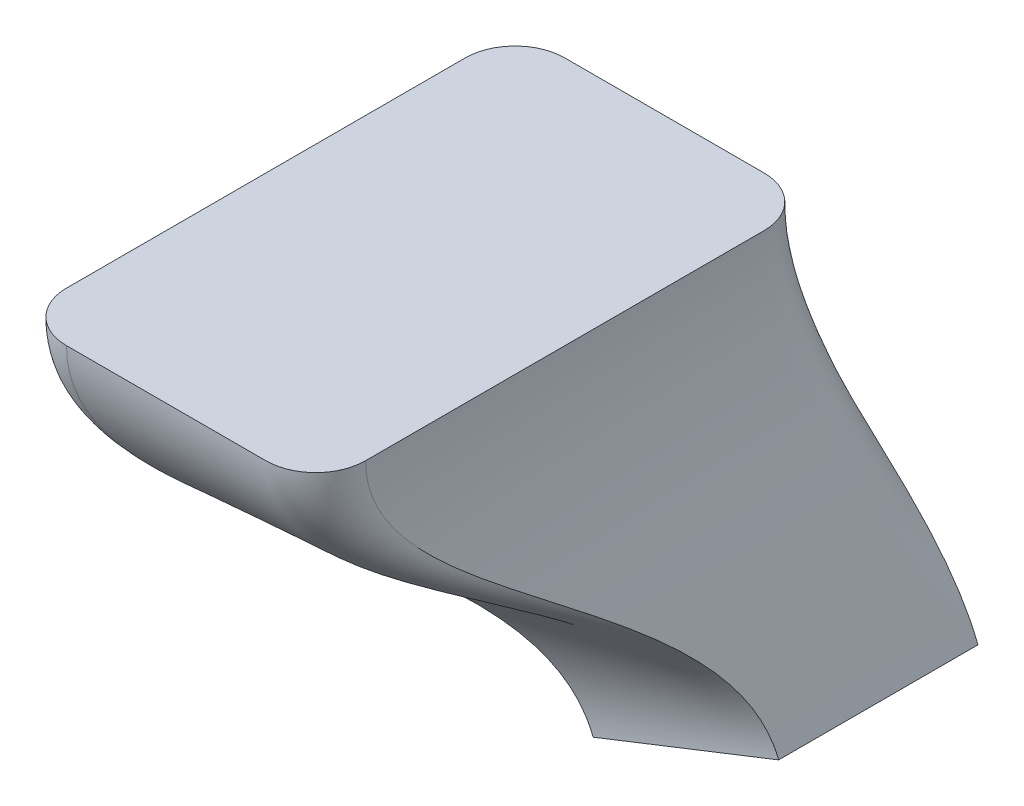
ISO-10303-21;
HEADER;
FILE_DESCRIPTION(('STEP AP214'),'2;1');
FILE_NAME('part.step','',(''),(''),'','','');
FILE_SCHEMA(('AUTOMOTIVE_DESIGN { 1 0 10303 214 1 1 1 1 }'));
ENDSEC;
DATA;
#1=APPLICATION_CONTEXT('core data for automotive mechanical design processes');
#2=APPLICATION_PROTOCOL_DEFINITION('international standard','automotive_design',2000,#1);
#3=PRODUCT_CONTEXT('',#1,'mechanical');
#4=PRODUCT('Part','Part','',(#3));
#5=PRODUCT_RELATED_PRODUCT_CATEGORY('part','',(#4));
#6=PRODUCT_DEFINITION_FORMATION('','',#4);
#7=PRODUCT_DEFINITION_CONTEXT('part definition',#1,'design');
#8=PRODUCT_DEFINITION('design','',#6,#7);
#9=PRODUCT_DEFINITION_SHAPE('','',#8);
#10=(LENGTH_UNIT() NAMED_UNIT(*) SI_UNIT(.MILLI.,.METRE.));
#11=(NAMED_UNIT(*) PLANE_ANGLE_UNIT() SI_UNIT($,.RADIAN.));
#12=(NAMED_UNIT(*) SI_UNIT($,.STERADIAN.) SOLID_ANGLE_UNIT());
#13=UNCERTAINTY_MEASURE_WITH_UNIT(LENGTH_MEASURE(1.E-05),#10,'distance_accuracy_value','');
#14=(GEOMETRIC_REPRESENTATION_CONTEXT(3) GLOBAL_UNCERTAINTY_ASSIGNED_CONTEXT((#13)) GLOBAL_UNIT_ASSIGNED_CONTEXT((#10,
#11,#12)) REPRESENTATION_CONTEXT('',''));
#15=CARTESIAN_POINT('',(0.,0.,0.));
#16=DIRECTION('',(0.,0.,1.));
#17=DIRECTION('',(1.,0.,0.));
#18=AXIS2_PLACEMENT_3D('',#15,#16,#17);
#19=CARTESIAN_POINT('',(91.5886055755659,0.,0.));
#20=CARTESIAN_POINT('',(91.5886055755659,-127.568491475437,0.));
#21=CARTESIAN_POINT('',(195.455030253132,-239.767306015432,-52.2088786404502));
#22=CARTESIAN_POINT('',(243.699720401359,-362.248980616551,-52.2088786404502));
#23=CARTESIAN_POINT('',(92.2895551109354,0.,0.));
#24=CARTESIAN_POINT('',(92.2895551109354,-127.441071303254,0.));
#25=CARTESIAN_POINT('',(197.035138804204,-239.231142171561,-52.2088786404502));
#26=CARTESIAN_POINT('',(245.250425520115,-361.638168523973,-52.2088786404502));
#27=CARTESIAN_POINT('',(93.6914541816744,0.,0.));
#28=CARTESIAN_POINT('',(93.6914541816744,-127.186230958887,0.));
#29=CARTESIAN_POINT('',(200.195355906347,-238.158814483818,-52.2088786404503));
#30=CARTESIAN_POINT('',(248.351835757628,-360.416544338816,-52.2088786404503));
#31=CARTESIAN_POINT('',(95.7943027877829,0.,0.));
#32=CARTESIAN_POINT('',(95.7943027877829,-126.810076949941,0.));
#33=CARTESIAN_POINT('',(204.933443602349,-236.544641316642,-52.2088786404501));
#34=CARTESIAN_POINT('',(253.003951113897,-358.584108061077,-52.2088786404501));
#35=CARTESIAN_POINT('',(97.8971513938914,0.,0.));
#36=CARTESIAN_POINT('',(97.8971513938914,-126.438018198312,0.));
#37=CARTESIAN_POINT('',(209.670030438736,-234.926657827579,-52.2088786404503));
#38=CARTESIAN_POINT('',(257.656066470167,-356.751671783342,-52.2088786404503));
#39=CARTESIAN_POINT('',(99.2990504646304,0.,0.));
#40=CARTESIAN_POINT('',(99.2990504646304,-126.194097116168,0.));
#41=CARTESIAN_POINT('',(212.826245770435,-233.844170606342,-52.2088786404502));
#42=CARTESIAN_POINT('',(260.757476707679,-355.530047598184,-52.2088786404502));
#43=CARTESIAN_POINT('',(99.9999999999999,0.,0.));
#44=CARTESIAN_POINT('',(99.9999999999999,-126.072136575096,0.));
#45=CARTESIAN_POINT('',(214.404353436284,-233.302926995724,-52.2088786404502));
#46=CARTESIAN_POINT('',(262.308181826436,-354.919235505605,-52.2088786404502));
#47=B_SPLINE_SURFACE_WITH_KNOTS('',3,3,((#19,#20,#21,#22),(#23,#24,#25,#26),(#27,#28,#29,#30),
(#31,#32,#33,#34),(#35,#36,#37,#38),(#39,#40,#41,#42),(#43,#44,#45,#46)),.UNSPECIFIED.,.F.,.F.,
.F.,(4,1,1,1,4),(4,4),(0.,0.25,0.5,0.75,1.),(0.,1.),.UNSPECIFIED.);
#48=DIRECTION('',(1.,0.,0.));
#49=VECTOR('',#48,1.);
#50=CARTESIAN_POINT('',(95.7943027877829,0.,0.));
#51=LINE('',#50,#49);
#52=CARTESIAN_POINT('',(91.5886055755659,0.,0.));
#53=VERTEX_POINT('',#52);
#54=CARTESIAN_POINT('',(100.,0.,0.));
#55=VERTEX_POINT('',#54);
#56=EDGE_CURVE('E12',#53,#55,#51,.T.);
#57=CARTESIAN_POINT('',(100.,0.,0.));
#58=CARTESIAN_POINT('',(100.,-126.072136575096,0.));
#59=CARTESIAN_POINT('',(214.404353436284,-233.302926995724,-52.2088786404502));
#60=CARTESIAN_POINT('',(262.308181826436,-354.919235505605,-52.2088786404502));
#61=B_SPLINE_CURVE_WITH_KNOTS('',3,(#57,#58,#59,#60),.UNSPECIFIED.,.F.,.F.,(4,4),(0.,1.),.UNSPECIFIED.);
#62=CARTESIAN_POINT('',(262.308181826436,-354.919235505605,-52.2088786404502));
#63=VERTEX_POINT('',#62);
#64=EDGE_CURVE('E165',#55,#63,#61,.T.);
#65=DIRECTION('',(0.930423071253835,0.366487255547286,0.));
#66=VECTOR('',#65,1.);
#67=CARTESIAN_POINT('',(253.003951113897,-358.584108061078,-52.2088786404502));
#68=LINE('',#67,#66);
#69=CARTESIAN_POINT('',(243.699720401359,-362.248980616551,-52.2088786404502));
#70=VERTEX_POINT('',#69);
#71=EDGE_CURVE('E250',#70,#63,#68,.T.);
#72=CARTESIAN_POINT('',(91.5886055755659,0.,0.));
#73=CARTESIAN_POINT('',(91.5886055755659,-127.568491475437,0.));
#74=CARTESIAN_POINT('',(195.455030253132,-239.767306015432,-52.2088786404502));
#75=CARTESIAN_POINT('',(243.699720401359,-362.248980616551,-52.2088786404502));
#76=B_SPLINE_CURVE_WITH_KNOTS('',3,(#72,#73,#74,#75),.UNSPECIFIED.,.F.,.F.,(4,4),(0.,1.),.UNSPECIFIED.);
#77=EDGE_CURVE('E227',#53,#70,#76,.T.);
#78=ORIENTED_EDGE('',*,*,#56,.T.);
#79=ORIENTED_EDGE('',*,*,#64,.T.);
#80=ORIENTED_EDGE('',*,*,#71,.F.);
#81=ORIENTED_EDGE('',*,*,#77,.F.);
#82=EDGE_LOOP('',(#78,#79,#80,#81));
#83=FACE_BOUND('',#82,.T.);
#84=ADVANCED_FACE('F153',(#83),#47,.T.);
#85=CARTESIAN_POINT('',(100.,0.,0.));
#86=CARTESIAN_POINT('',(100.,-126.072136575096,0.));
#87=CARTESIAN_POINT('',(214.404353436284,-233.302926995724,-52.2088786404502));
#88=CARTESIAN_POINT('',(262.308181826436,-354.919235505605,-52.2088786404502));
#89=CARTESIAN_POINT('',(103.15324016718,0.,0.));
#90=CARTESIAN_POINT('',(103.15324016718,-125.784457137878,0.));
#91=CARTESIAN_POINT('',(214.56669132179,-233.715063875592,-50.8941898589131));
#92=CARTESIAN_POINT('',(262.308181826436,-354.919235505605,-50.8941898589131));
#93=CARTESIAN_POINT('',(109.544336504901,0.,0.599046323201212));
#94=CARTESIAN_POINT('',(109.544336504901,-125.209098263442,0.599046323201212));
#95=CARTESIAN_POINT('',(214.8913670928,-234.539337635329,-48.3153002930462));
#96=CARTESIAN_POINT('',(262.308181826436,-354.919235505605,-48.3153002930462));
#97=CARTESIAN_POINT('',(118.975849046828,0.,3.38859100595984));
#98=CARTESIAN_POINT('',(118.975849046828,-124.469072853807,3.38859100595984));
#99=CARTESIAN_POINT('',(215.331735315977,-235.657326729054,-44.5538509365087));
#100=CARTESIAN_POINT('',(262.308181826436,-354.919235505605,-44.5538509365087));
#101=CARTESIAN_POINT('',(127.804993430476,0.,8.04367424785114));
#102=CARTESIAN_POINT('',(127.804993430476,-123.854103227105,8.04367424785114));
#103=CARTESIAN_POINT('',(215.715169190903,-236.630773194465,-40.8547075728747));
#104=CARTESIAN_POINT('',(262.308181826436,-354.919235505605,-40.8547075728747));
#105=CARTESIAN_POINT('',(135.592896034395,0.,14.4071039656046));
#106=CARTESIAN_POINT('',(135.592896034395,-123.392871047849,14.4071039656046));
#107=CARTESIAN_POINT('',(216.023660118153,-237.413957525273,-37.1867392570297));
#108=CARTESIAN_POINT('',(262.308181826436,-354.919235505605,-37.1867392570297));
#109=CARTESIAN_POINT('',(141.956325752149,0.,22.1950065695246));
#110=CARTESIAN_POINT('',(141.956325752149,-123.09542132401,22.1950065695246));
#111=CARTESIAN_POINT('',(216.246745088573,-237.980316655604,-33.5188150438592));
#112=CARTESIAN_POINT('',(262.308181826436,-354.919235505605,-33.5188150438592));
#113=CARTESIAN_POINT('',(146.61140899404,0.,31.0241509531723));
#114=CARTESIAN_POINT('',(146.61140899404,-122.965050909416,31.0241509531723));
#115=CARTESIAN_POINT('',(216.377444106752,-238.312130054469,-29.8197238644276));
#116=CARTESIAN_POINT('',(262.308181826436,-354.919235505605,-29.8197238644276));
#117=CARTESIAN_POINT('',(149.400953676799,0.,40.4556634950995));
#118=CARTESIAN_POINT('',(149.400953676799,-122.983371412557,40.4556634950995));
#119=CARTESIAN_POINT('',(216.422351906205,-238.426140165484,-26.0582546497995));
#120=CARTESIAN_POINT('',(262.308181826436,-354.919235505605,-26.0582546497995));
#121=CARTESIAN_POINT('',(150.,0.,46.8513119953283));
#122=CARTESIAN_POINT('',(150.,-123.099626214496,46.8513119953283));
#123=CARTESIAN_POINT('',(216.386328612456,-238.334685679415,-23.4811731800881));
#124=CARTESIAN_POINT('',(262.308181826436,-354.919235505605,-23.4811731800881));
#125=CARTESIAN_POINT('',(150.,0.,83.5719172936581));
#126=CARTESIAN_POINT('',(150.,-123.820984763146,83.5719172936581));
#127=CARTESIAN_POINT('',(216.154979970663,-237.747347073313,-8.12771608188114));
#128=CARTESIAN_POINT('',(262.308181826436,-354.919235505606,-8.12771608188114));
#129=CARTESIAN_POINT('',(150.,0.,150.353482061318));
#130=CARTESIAN_POINT('',(150.,-125.987393331563,150.353482061318));
#131=CARTESIAN_POINT('',(215.316825080135,-235.61947322333,20.1329663872693));
#132=CARTESIAN_POINT('',(262.308181826435,-354.919235505605,20.1329663872693));
#133=CARTESIAN_POINT('',(150.,0.,249.999990485628));
#134=CARTESIAN_POINT('',(150.,-130.454173320858,249.999990485628));
#135=CARTESIAN_POINT('',(213.697546889415,-231.508515025958,62.8132368901412));
#136=CARTESIAN_POINT('',(262.308181826436,-354.919235505606,62.8132368901412));
#137=CARTESIAN_POINT('',(150.,0.,349.646534093337));
#138=CARTESIAN_POINT('',(150.,-136.143634462779,349.646534093337));
#139=CARTESIAN_POINT('',(211.60776353505,-226.203057285227,105.493487852625));
#140=CARTESIAN_POINT('',(262.308181826435,-354.919235505605,105.493487852625));
#141=CARTESIAN_POINT('',(150.,0.,416.428509650664));
#142=CARTESIAN_POINT('',(150.,-140.861634924923,416.428509650664));
#143=CARTESIAN_POINT('',(209.879298941331,-221.814901049233,133.754008438342));
#144=CARTESIAN_POINT('',(262.308181826436,-354.919235505605,133.754008438342));
#145=CARTESIAN_POINT('',(150.,0.,450.));
#146=CARTESIAN_POINT('',(150.,-143.220635155995,450.));
#147=CARTESIAN_POINT('',(209.015066644471,-219.620822931236,147.79112135955));
#148=CARTESIAN_POINT('',(262.308181826436,-354.919235505605,147.79112135955));
#149=B_SPLINE_SURFACE_WITH_KNOTS('',3,3,((#85,#86,#87,#88),(#89,#90,#91,#92),(#93,#94,#95,#96),
(#97,#98,#99,#100),(#101,#102,#103,#104),(#105,#106,#107,#108),(#109,#110,#111,#112),(#113,#114,
#115,#116),(#117,#118,#119,#120),(#121,#122,#123,#124),(#125,#126,#127,#128),(#129,#130,#131,
#132),(#133,#134,#135,#136),(#137,#138,#139,#140),(#141,#142,#143,#144),(#145,#146,#147,#148)),
.UNSPECIFIED.,.F.,.F.,.F.,(4,1,1,1,1,1,1,1,2,1,1,1,4),(4,4),(0.,0.019743816254417,
0.0394876325088339,0.0592314487632509,0.0789752650176678,0.0987190812720848,0.118462897526502,
0.138206713780919,0.157950530035336,0.368462897526502,0.578975265017668,0.789487632508834,1.),
(0.,1.),.UNSPECIFIED.);
#150=CARTESIAN_POINT('',(100.,0.,50.));
#151=DIRECTION('',(0.,1.,0.));
#152=DIRECTION('',(0.,0.,-1.));
#153=AXIS2_PLACEMENT_3D('',#150,#151,#152);
#154=CIRCLE('',#153,50.);
#155=CARTESIAN_POINT('',(150.,0.,49.9999999999956));
#156=VERTEX_POINT('',#155);
#157=EDGE_CURVE('E239',#55,#156,#154,.F.);
#158=DIRECTION('',(0.,0.,1.));
#159=VECTOR('',#158,1.);
#160=CARTESIAN_POINT('',(150.,0.,50.));
#161=LINE('',#160,#159);
#162=CARTESIAN_POINT('',(150.,0.,450.));
#163=VERTEX_POINT('',#162);
#164=EDGE_CURVE('E319',#156,#163,#161,.T.);
#165=CARTESIAN_POINT('',(150.,0.,450.));
#166=CARTESIAN_POINT('',(150.,-143.220635155995,450.));
#167=CARTESIAN_POINT('',(209.015066644471,-219.620822931236,147.79112135955));
#168=CARTESIAN_POINT('',(262.308181826436,-354.919235505605,147.79112135955));
#169=B_SPLINE_CURVE_WITH_KNOTS('',3,(#165,#166,#167,#168),.UNSPECIFIED.,.F.,.F.,(4,4),(0.,1.),.UNSPECIFIED.);
#170=CARTESIAN_POINT('',(262.308181826436,-354.919235505605,147.79112135955));
#171=VERTEX_POINT('',#170);
#172=EDGE_CURVE('E616',#163,#171,#169,.T.);
#173=DIRECTION('',(0.,0.,1.));
#174=VECTOR('',#173,1.);
#175=CARTESIAN_POINT('',(262.308181826436,-354.919235505605,46.8039637005041));
#176=LINE('',#175,#174);
#177=EDGE_CURVE('E303',#63,#171,#176,.T.);
#178=ORIENTED_EDGE('',*,*,#157,.T.);
#179=ORIENTED_EDGE('',*,*,#164,.T.);
#180=ORIENTED_EDGE('',*,*,#172,.T.);
#181=ORIENTED_EDGE('',*,*,#177,.F.);
#182=ORIENTED_EDGE('',*,*,#64,.F.);
#183=EDGE_LOOP('',(#178,#179,#180,#181,#182));
#184=FACE_BOUND('',#183,.T.);
#185=ADVANCED_FACE('F272',(#184),#149,.T.);
#186=CARTESIAN_POINT('',(150.,0.,450.));
#187=CARTESIAN_POINT('',(150.,-143.220635155995,450.));
#188=CARTESIAN_POINT('',(209.015066644471,-219.620822931236,147.79112135955));
#189=CARTESIAN_POINT('',(262.308181826436,-354.919235505605,147.79112135955));
#190=CARTESIAN_POINT('',(150.,0.,453.13304755579));
#191=CARTESIAN_POINT('',(150.,-143.763891585565,453.13304755579));
#192=CARTESIAN_POINT('',(206.759073873974,-220.033906019429,147.79112135955));
#193=CARTESIAN_POINT('',(260.214341548633,-355.743984805869,147.79112135955));
#194=CARTESIAN_POINT('',(149.408575002499,0.,459.49687781042));
#195=CARTESIAN_POINT('',(149.408575002499,-144.850404444704,459.49687781042));
#196=CARTESIAN_POINT('',(202.301037763055,-220.838821885952,147.79112135955));
#197=CARTESIAN_POINT('',(256.080610423102,-357.372233096537,147.79112135955));
#198=CARTESIAN_POINT('',(146.632480687065,0.,468.92553396559));
#199=CARTESIAN_POINT('',(146.632480687065,-146.607806711187,468.925533965589));
#200=CARTESIAN_POINT('',(195.638158879046,-221.766306322958,147.79112135955));
#201=CARTESIAN_POINT('',(249.996380934107,-359.768769292202,147.79112135955));
#202=CARTESIAN_POINT('',(141.977017542744,0.,477.777332582936));
#203=CARTESIAN_POINT('',(141.977017542744,-148.370812598893,477.777332582936));
#204=CARTESIAN_POINT('',(189.01159440265,-222.578099968546,147.79112135955));
#205=CARTESIAN_POINT('',(243.983037553495,-362.137383936779,147.79112135955));
#206=CARTESIAN_POINT('',(135.594660714696,0.,485.594660714695));
#207=CARTESIAN_POINT('',(135.594660714696,-150.077825791104,485.594660714695));
#208=CARTESIAN_POINT('',(182.408736859181,-223.346094377498,147.79112135955));
#209=CARTESIAN_POINT('',(238.005151981467,-364.492031994157,147.79112135955));
#210=CARTESIAN_POINT('',(127.777332582935,0.,491.977017542745));
#211=CARTESIAN_POINT('',(127.777332582935,-151.65709204318,491.977017542745));
#212=CARTESIAN_POINT('',(175.827177558391,-224.168073367407,147.79112135955));
#213=CARTESIAN_POINT('',(232.027295918225,-366.846668428228,147.79112135955));
#214=CARTESIAN_POINT('',(118.92553396559,0.,496.632480687065));
#215=CARTESIAN_POINT('',(118.92553396559,-153.048508139389,496.632480687065));
#216=CARTESIAN_POINT('',(169.26123131024,-225.133660444698,147.79112135955));
#217=CARTESIAN_POINT('',(226.013987210194,-369.215269415514,147.79112135955));
#218=CARTESIAN_POINT('',(109.49687781042,0.,499.408575002499));
#219=CARTESIAN_POINT('',(109.49687781042,-154.232573183355,499.408575002499));
#220=CARTESIAN_POINT('',(162.690969495064,-226.296318470824,147.79112135955));
#221=CARTESIAN_POINT('',(219.9297437038,-371.611811132536,147.79112135955));
#222=CARTESIAN_POINT('',(103.134475447474,0.,500.));
#223=CARTESIAN_POINT('',(103.134475447474,-154.82704663687,500.));
#224=CARTESIAN_POINT('',(158.30576647148,-227.28629676616,147.79112135955));
#225=CARTESIAN_POINT('',(215.795959137713,-373.240080473071,147.79112135955));
#226=CARTESIAN_POINT('',(83.0545764204814,0.,500.));
#227=CARTESIAN_POINT('',(83.0545764204813,-156.694779307896,500.));
#228=CARTESIAN_POINT('',(144.103052268238,-230.565220164763,147.79112135955));
#229=CARTESIAN_POINT('',(202.382778606717,-378.523440132609,147.79112135955));
#230=CARTESIAN_POINT('',(49.5916734365435,0.,500.));
#231=CARTESIAN_POINT('',(49.5916734365435,-159.514929868162,500.));
#232=CARTESIAN_POINT('',(120.073632207478,-236.544458586688,147.79112135955));
#233=CARTESIAN_POINT('',(179.541970109175,-387.520277678206,147.79112135955));
#234=CARTESIAN_POINT('',(2.89370835140912E-05,0.,500.));
#235=CARTESIAN_POINT('',(2.89370835140912E-05,-164.117642719849,500.));
#236=CARTESIAN_POINT('',(83.5828296183226,-245.311573603176,147.79112135955));
#237=CARTESIAN_POINT('',(144.962870598393,-401.140747409169,147.79112135955));
#238=CARTESIAN_POINT('',(-49.5917204783581,0.,500.));
#239=CARTESIAN_POINT('',(-49.5917204783581,-168.711764520914,500.));
#240=CARTESIAN_POINT('',(47.0999097816488,-254.098782033139,147.79112135955));
#241=CARTESIAN_POINT('',(110.383743467831,-414.761228019376,147.79112135955));
#242=CARTESIAN_POINT('',(-83.0543122965774,0.,500.));
#243=CARTESIAN_POINT('',(-83.0543122965774,-171.872475210272,500.));
#244=CARTESIAN_POINT('',(22.9361638049299,-259.736981662233,147.79112135955));
#245=CARTESIAN_POINT('',(87.5429409621607,-423.758063204815,147.79112135955));
#246=CARTESIAN_POINT('',(-100.,0.,500.));
#247=CARTESIAN_POINT('',(-99.9999999999999,-173.452830554951,500.));
#248=CARTESIAN_POINT('',(10.955318682915,-262.516287294311,147.79112135955));
#249=CARTESIAN_POINT('',(76.2235675756703,-428.216686615067,147.79112135955));
#250=B_SPLINE_SURFACE_WITH_KNOTS('',3,3,((#186,#187,#188,#189),(#190,#191,#192,#193),(#194,#195,
#196,#197),(#198,#199,#200,#201),(#202,#203,#204,#205),(#206,#207,#208,#209),(#210,#211,#212,
#213),(#214,#215,#216,#217),(#218,#219,#220,#221),(#222,#223,#224,#225),(#226,#227,#228,#229),
(#230,#231,#232,#233),(#234,#235,#236,#237),(#238,#239,#240,#241),(#242,#243,#244,#245),(#246,
#247,#248,#249)),.UNSPECIFIED.,.F.,.F.,.F.,(4,1,1,1,1,1,1,1,2,1,1,1,4),(4,4),(0.,
0.0337557603686636,0.0675115207373271,0.101267281105991,0.135023041474654,0.168778801843318,
0.202534562211981,0.236290322580645,0.270046082949309,0.452534562211981,0.635023041474654,
0.817511520737327,1.),(0.,1.),.UNSPECIFIED.);
#251=CARTESIAN_POINT('',(100.,0.,450.));
#252=DIRECTION('',(0.,-1.,0.));
#253=DIRECTION('',(0.,0.,1.));
#254=AXIS2_PLACEMENT_3D('',#251,#252,#253);
#255=CIRCLE('',#254,50.);
#256=CARTESIAN_POINT('',(100.000000000588,0.,500.));
#257=VERTEX_POINT('',#256);
#258=EDGE_CURVE('E615',#163,#257,#255,.T.);
#259=DIRECTION('',(-1.,0.,0.));
#260=VECTOR('',#259,1.);
#261=CARTESIAN_POINT('',(-99.9999999999999,0.,500.));
#262=LINE('',#261,#260);
#263=CARTESIAN_POINT('',(-100.,0.,500.));
#264=VERTEX_POINT('',#263);
#265=EDGE_CURVE('E181',#257,#264,#262,.T.);
#266=CARTESIAN_POINT('',(-100.,0.,500.));
#267=CARTESIAN_POINT('',(-99.9999999999999,-173.452830554951,500.));
#268=CARTESIAN_POINT('',(10.955318682915,-262.516287294311,147.79112135955));
#269=CARTESIAN_POINT('',(76.2235675756703,-428.216686615067,147.79112135955));
#270=B_SPLINE_CURVE_WITH_KNOTS('',3,(#266,#267,#268,#269),.UNSPECIFIED.,.F.,.F.,(4,4),(0.,1.),.UNSPECIFIED.);
#271=CARTESIAN_POINT('',(76.2235675756703,-428.216686615067,147.79112135955));
#272=VERTEX_POINT('',#271);
#273=EDGE_CURVE('E511',#264,#272,#270,.T.);
#274=DIRECTION('',(-0.930423071253821,-0.36648725554732,0.));
#275=VECTOR('',#274,1.);
#276=CARTESIAN_POINT('',(170.526450883117,-391.071428762668,147.79112135955));
#277=LINE('',#276,#275);
#278=EDGE_CURVE('E311',#171,#272,#277,.T.);
#279=ORIENTED_EDGE('',*,*,#258,.T.);
#280=ORIENTED_EDGE('',*,*,#265,.T.);
#281=ORIENTED_EDGE('',*,*,#273,.T.);
#282=ORIENTED_EDGE('',*,*,#278,.F.);
#283=ORIENTED_EDGE('',*,*,#172,.F.);
#284=EDGE_LOOP('',(#279,#280,#281,#282,#283));
#285=FACE_BOUND('',#284,.T.);
#286=ADVANCED_FACE('F562',(#285),#250,.T.);
#287=CARTESIAN_POINT('',(-100.,0.,500.));
#288=CARTESIAN_POINT('',(-99.9999999999999,-173.452830554951,500.));
#289=CARTESIAN_POINT('',(10.955318682915,-262.516287294311,147.79112135955));
#290=CARTESIAN_POINT('',(76.2235675756703,-428.216686615067,147.79112135955));
#291=CARTESIAN_POINT('',(-103.272492347489,0.,500.));
#292=CARTESIAN_POINT('',(-103.272492347489,-173.732195211385,500.));
#293=CARTESIAN_POINT('',(10.7943302620893,-262.107576380974,146.957788026216));
#294=CARTESIAN_POINT('',(76.2235675756703,-428.216686615067,146.957788026216));
#295=CARTESIAN_POINT('',(-109.817398802326,0.,499.355567966542));
#296=CARTESIAN_POINT('',(-109.817398802326,-174.290924524254,499.355567966542));
#297=CARTESIAN_POINT('',(10.4723534204379,-261.290154554301,145.29112135955));
#298=CARTESIAN_POINT('',(76.2235675756703,-428.216686615067,145.29112135955));
#299=CARTESIAN_POINT('',(-119.257556948028,0.,496.49180786364));
#300=CARTESIAN_POINT('',(-119.257556948028,-174.848783739326,496.49180786364));
#301=CARTESIAN_POINT('',(10.0988500085328,-260.341919148108,142.79112135955));
#302=CARTESIAN_POINT('',(76.2235675756703,-428.216686615066,142.79112135955));
#303=CARTESIAN_POINT('',(-127.957636191679,0.,491.841580871353));
#304=CARTESIAN_POINT('',(-127.957636191679,-175.184732433472,491.841580871353));
#305=CARTESIAN_POINT('',(9.81991454509998,-259.633769037455,140.29112135955));
#306=CARTESIAN_POINT('',(76.2235675756703,-428.216686615067,140.29112135955));
#307=CARTESIAN_POINT('',(-135.583310942403,0.,485.583310942405));
#308=CARTESIAN_POINT('',(-135.583310942403,-175.2761833184,485.583310942405));
#309=CARTESIAN_POINT('',(9.64987314906439,-259.202074795582,137.79112135955));
#310=CARTESIAN_POINT('',(76.2235675756703,-428.216686615067,137.79112135955));
#311=CARTESIAN_POINT('',(-141.841580871354,0.,477.957636191678));
#312=CARTESIAN_POINT('',(-141.841580871354,-175.133674620344,477.957636191678));
#313=CARTESIAN_POINT('',(9.58988448762965,-259.049778000079,135.29112135955));
#314=CARTESIAN_POINT('',(76.2235675756704,-428.216686615067,135.29112135955));
#315=CARTESIAN_POINT('',(-146.49180786364,0.,469.257556948028));
#316=CARTESIAN_POINT('',(-146.49180786364,-174.765291643982,469.257556948028));
#317=CARTESIAN_POINT('',(9.64213938985417,-259.182440639447,132.79112135955));
#318=CARTESIAN_POINT('',(76.2235675756704,-428.216686615066,132.79112135955));
#319=CARTESIAN_POINT('',(-149.355567966542,0.,459.817398802326));
#320=CARTESIAN_POINT('',(-149.355567966542,-174.204805322519,459.817398802326));
#321=CARTESIAN_POINT('',(9.79430469714863,-259.568751787811,130.29112135955));
#322=CARTESIAN_POINT('',(76.2235675756703,-428.216686615067,130.29112135955));
#323=CARTESIAN_POINT('',(-150.,0.,453.272492347489));
#324=CARTESIAN_POINT('',(-150.,-173.690862763937,453.272492347489));
#325=CARTESIAN_POINT('',(9.97599504635389,-260.030019922421,128.624454692883));
#326=CARTESIAN_POINT('',(76.2235675756703,-428.216686615067,128.624454692883));
#327=CARTESIAN_POINT('',(-150.,0.,450.));
#328=CARTESIAN_POINT('',(-150.,-173.433891484645,450.));
#329=CARTESIAN_POINT('',(10.0668402209566,-260.260653989727,127.79112135955));
#330=CARTESIAN_POINT('',(76.2235675756703,-428.216686615067,127.79112135955));
#331=B_SPLINE_SURFACE_WITH_KNOTS('',3,3,((#287,#288,#289,#290),(#291,#292,#293,#294),(#295,#296,
#297,#298),(#299,#300,#301,#302),(#303,#304,#305,#306),(#307,#308,#309,#310),(#311,#312,#313,
#314),(#315,#316,#317,#318),(#319,#320,#321,#322),(#323,#324,#325,#326),(#327,#328,#329,#330)),
.UNSPECIFIED.,.F.,.F.,.F.,(4,1,1,1,1,1,1,1,4),(4,4),(0.,0.125,0.25,0.375,0.5,0.625,0.75,0.875,
1.),(0.,1.),.UNSPECIFIED.);
#332=CARTESIAN_POINT('',(-100.,0.,450.));
#333=DIRECTION('',(0.,1.,0.));
#334=DIRECTION('',(0.,0.,1.));
#335=AXIS2_PLACEMENT_3D('',#332,#333,#334);
#336=CIRCLE('',#335,50.);
#337=CARTESIAN_POINT('',(-150.,0.,450.));
#338=VERTEX_POINT('',#337);
#339=EDGE_CURVE('E497',#264,#338,#336,.F.);
#340=CARTESIAN_POINT('',(-150.,0.,450.));
#341=CARTESIAN_POINT('',(-150.,-173.433891484645,450.));
#342=CARTESIAN_POINT('',(10.0668402209566,-260.260653989727,127.79112135955));
#343=CARTESIAN_POINT('',(76.2235675756703,-428.216686615067,127.79112135955));
#344=B_SPLINE_CURVE_WITH_KNOTS('',3,(#340,#341,#342,#343),.UNSPECIFIED.,.F.,.F.,(4,4),(0.,1.),.UNSPECIFIED.);
#345=CARTESIAN_POINT('',(76.2235675756703,-428.216686615067,127.79112135955));
#346=VERTEX_POINT('',#345);
#347=EDGE_CURVE('E494',#338,#346,#344,.T.);
#348=DIRECTION('',(0.,0.,-1.));
#349=VECTOR('',#348,1.);
#350=CARTESIAN_POINT('',(76.2235675756703,-428.216686615067,137.79112135955));
#351=LINE('',#350,#349);
#352=EDGE_CURVE('E491',#272,#346,#351,.T.);
#353=ORIENTED_EDGE('',*,*,#339,.T.);
#354=ORIENTED_EDGE('',*,*,#347,.T.);
#355=ORIENTED_EDGE('',*,*,#352,.F.);
#356=ORIENTED_EDGE('',*,*,#273,.F.);
#357=EDGE_LOOP('',(#353,#354,#355,#356));
#358=FACE_BOUND('',#357,.T.);
#359=ADVANCED_FACE('F455',(#358),#331,.T.);
#360=CARTESIAN_POINT('',(-150.,0.,450.));
#361=CARTESIAN_POINT('',(-150.,-173.433891484645,450.));
#362=CARTESIAN_POINT('',(10.0668402209566,-260.260653989727,127.79112135955));
#363=CARTESIAN_POINT('',(76.2235675756703,-428.216686615067,127.79112135955));
#364=CARTESIAN_POINT('',(-150.,0.,416.43505652195));
#365=CARTESIAN_POINT('',(-150.,-169.630483613819,416.43505652195));
#366=CARTESIAN_POINT('',(22.9800005100887,-258.597299531318,127.79112135955));
#367=CARTESIAN_POINT('',(87.96950798793,-423.590041383978,127.79112135955));
#368=CARTESIAN_POINT('',(-150.,0.,349.65615068353));
#369=CARTESIAN_POINT('',(-150.,-162.023667872166,349.65615068353));
#370=CARTESIAN_POINT('',(48.9746697697919,-255.204279225476,127.79112135955));
#371=CARTESIAN_POINT('',(111.629737493888,-414.270439532776,127.79112135955));
#372=CARTESIAN_POINT('',(-150.,0.,249.999991021921));
#373=CARTESIAN_POINT('',(-150.,-155.358803208826,249.999991021921));
#374=CARTESIAN_POINT('',(86.4761958311451,-245.561457984543,127.79112135955));
#375=CARTESIAN_POINT('',(147.382412754997,-400.187706376493,127.79112135955));
#376=CARTESIAN_POINT('',(-150.,0.,150.343864575522));
#377=CARTESIAN_POINT('',(-150.,-152.703437602912,150.343864575522));
#378=CARTESIAN_POINT('',(122.533173312011,-232.251219511525,127.79112135955));
#379=CARTESIAN_POINT('',(183.13510694975,-386.104965762376,127.79112135955));
#380=CARTESIAN_POINT('',(-150.,0.,83.5648047040387));
#381=CARTESIAN_POINT('',(-150.,-154.400143363443,83.5648047040387));
#382=CARTESIAN_POINT('',(145.068486083559,-220.075748662888,127.79112135955));
#383=CARTESIAN_POINT('',(206.795328182515,-376.785367169928,127.79112135955));
#384=CARTESIAN_POINT('',(-150.,0.,46.8417833079313));
#385=CARTESIAN_POINT('',(-150.,-155.627880702138,46.8417833079313));
#386=CARTESIAN_POINT('',(157.257947867036,-213.333897405561,127.79112135955));
#387=CARTESIAN_POINT('',(219.646479611687,-371.72338691233,127.79112135955));
#388=CARTESIAN_POINT('',(-149.399629900174,0.,40.4474693841644));
#389=CARTESIAN_POINT('',(-149.399629900174,-155.843902133199,40.4474693841644));
#390=CARTESIAN_POINT('',(159.30780756293,-212.190502720029,127.79112135955));
#391=CARTESIAN_POINT('',(221.810900783139,-370.870836282965,127.79112135955));
#392=CARTESIAN_POINT('',(-146.607779467808,0.,31.0155056536118));
#393=CARTESIAN_POINT('',(-146.607779467808,-155.86956110485,31.0155056536118));
#394=CARTESIAN_POINT('',(162.43933684965,-210.903553811835,127.79112135955));
#395=CARTESIAN_POINT('',(224.960659652345,-369.630167903949,127.79112135955));
#396=CARTESIAN_POINT('',(-141.952776682023,0.,22.1902663428547));
#397=CARTESIAN_POINT('',(-141.952776682023,-155.660249173828,22.1902663428547));
#398=CARTESIAN_POINT('',(165.633285565363,-209.938869841522,127.79112135955));
#399=CARTESIAN_POINT('',(228.054565675082,-368.411499577436,127.79112135955));
#400=CARTESIAN_POINT('',(-135.592594475642,0.,14.4074055243569));
#401=CARTESIAN_POINT('',(-135.592594475642,-155.196192432136,14.4074055243569));
#402=CARTESIAN_POINT('',(168.924324023621,-209.302636648876,127.79112135955));
#403=CARTESIAN_POINT('',(231.120523195889,-367.20383997382,127.79112135955));
#404=CARTESIAN_POINT('',(-127.809733657146,0.,8.04722331797745));
#405=CARTESIAN_POINT('',(-127.809733657146,-154.50050991306,8.04722331797745));
#406=CARTESIAN_POINT('',(172.325557351756,-208.9462912482,127.79112135955));
#407=CARTESIAN_POINT('',(234.186436559308,-365.996197763497,127.79112135955));
#408=CARTESIAN_POINT('',(-118.984494346387,0.,3.39222053219118));
#409=CARTESIAN_POINT('',(-118.984494346387,-153.603199888476,3.39222053219118));
#410=CARTESIAN_POINT('',(175.846662287539,-208.812331762775,127.79112135955));
#411=CARTESIAN_POINT('',(237.280290253631,-364.777550048786,127.79112135955));
#412=CARTESIAN_POINT('',(-109.552530615836,0.,0.600370099825972));
#413=CARTESIAN_POINT('',(-109.552530615836,-152.553812232816,0.600370099825972));
#414=CARTESIAN_POINT('',(179.489711869835,-208.823952351613,127.79112135955));
#415=CARTESIAN_POINT('',(240.430068767151,-363.53687393201,127.79112135955));
#416=CARTESIAN_POINT('',(-103.156741833618,0.,0.));
#417=CARTESIAN_POINT('',(-103.156741833618,-151.777289349929,0.));
#418=CARTESIAN_POINT('',(182.010628294069,-208.876374995811,127.79112135955));
#419=CARTESIAN_POINT('',(242.594518071442,-362.684312221313,127.79112135955));
#420=CARTESIAN_POINT('',(-100.,0.,0.));
#421=CARTESIAN_POINT('',(-100.,-151.389027908486,0.));
#422=CARTESIAN_POINT('',(183.294064183958,-208.893535568497,127.79112135955));
#423=CARTESIAN_POINT('',(243.699720401359,-362.248980616551,127.79112135955));
#424=B_SPLINE_SURFACE_WITH_KNOTS('',3,3,((#360,#361,#362,#363),(#364,#365,#366,#367),(#368,#369,
#370,#371),(#372,#373,#374,#375),(#376,#377,#378,#379),(#380,#381,#382,#383),(#384,#385,#386,
#387),(#388,#389,#390,#391),(#392,#393,#394,#395),(#396,#397,#398,#399),(#400,#401,#402,#403),
(#404,#405,#406,#407),(#408,#409,#410,#411),(#412,#413,#414,#415),(#416,#417,#418,#419),(#420,
#421,#422,#423)),.UNSPECIFIED.,.F.,.F.,.F.,(4,1,1,1,2,1,1,1,1,1,1,1,4),(4,4),(0.,
0.210404731103308,0.420809462206616,0.631214193309924,0.841618924413232,0.861416558861578,
0.881214193309924,0.90101182775827,0.920809462206616,0.940607096654962,0.960404731103308,
0.980202365551654,1.),(0.,1.),.UNSPECIFIED.);
#425=DIRECTION('',(0.,0.,-1.));
#426=VECTOR('',#425,1.);
#427=CARTESIAN_POINT('',(-150.,0.,50.));
#428=LINE('',#427,#426);
#429=CARTESIAN_POINT('',(-150.,0.,50.0000000015116));
#430=VERTEX_POINT('',#429);
#431=EDGE_CURVE('E498',#338,#430,#428,.T.);
#432=CARTESIAN_POINT('',(-100.,0.,50.));
#433=DIRECTION('',(0.,-1.,0.));
#434=DIRECTION('',(0.,0.,1.));
#435=AXIS2_PLACEMENT_3D('',#432,#433,#434);
#436=CIRCLE('',#435,50.);
#437=CARTESIAN_POINT('',(-100.,0.,0.));
#438=VERTEX_POINT('',#437);
#439=EDGE_CURVE('E173',#430,#438,#436,.T.);
#440=CARTESIAN_POINT('',(-100.,0.,0.));
#441=CARTESIAN_POINT('',(-100.,-151.389027908486,0.));
#442=CARTESIAN_POINT('',(183.294064183958,-208.893535568497,127.79112135955));
#443=CARTESIAN_POINT('',(243.699720401359,-362.248980616551,127.79112135955));
#444=B_SPLINE_CURVE_WITH_KNOTS('',3,(#440,#441,#442,#443),.UNSPECIFIED.,.F.,.F.,(4,4),(0.,1.),.UNSPECIFIED.);
#445=CARTESIAN_POINT('',(243.699720401359,-362.248980616551,127.79112135955));
#446=VERTEX_POINT('',#445);
#447=EDGE_CURVE('E230',#438,#446,#444,.T.);
#448=DIRECTION('',(0.930423071253826,0.366487255547307,0.));
#449=VECTOR('',#448,1.);
#450=CARTESIAN_POINT('',(160.83641022127,-394.888269206571,127.79112135955));
#451=LINE('',#450,#449);
#452=EDGE_CURVE('E431',#346,#446,#451,.T.);
#453=ORIENTED_EDGE('',*,*,#431,.T.);
#454=ORIENTED_EDGE('',*,*,#439,.T.);
#455=ORIENTED_EDGE('',*,*,#447,.T.);
#456=ORIENTED_EDGE('',*,*,#452,.F.);
#457=ORIENTED_EDGE('',*,*,#347,.F.);
#458=EDGE_LOOP('',(#453,#454,#455,#456,#457));
#459=FACE_BOUND('',#458,.T.);
#460=ADVANCED_FACE('F444',(#459),#424,.T.);
#461=CARTESIAN_POINT('',(-100.,0.,0.));
#462=CARTESIAN_POINT('',(-100.,-151.389027908486,0.));
#463=CARTESIAN_POINT('',(183.294064183958,-208.893535568497,127.79112135955));
#464=CARTESIAN_POINT('',(243.699720401359,-362.248980616551,127.79112135955));
#465=CARTESIAN_POINT('',(-84.0342828687028,0.,0.));
#466=CARTESIAN_POINT('',(-84.0342828687028,-148.605461942635,0.));
#467=CARTESIAN_POINT('',(184.600125889264,-212.20931237848,112.79112135955));
#468=CARTESIAN_POINT('',(243.699720401359,-362.248980616551,112.79112135955));
#469=CARTESIAN_POINT('',(-52.1028486061085,0.,0.));
#470=CARTESIAN_POINT('',(-52.1028486061085,-143.038330010933,0.));
#471=CARTESIAN_POINT('',(187.212249299877,-218.840865998447,82.7911213595499));
#472=CARTESIAN_POINT('',(243.699720401359,-362.248980616552,82.7911213595499));
#473=CARTESIAN_POINT('',(-4.20569721221702,0.,0.));
#474=CARTESIAN_POINT('',(-4.20569721221702,-136.197280038214,0.));
#475=CARTESIAN_POINT('',(190.577167690982,-227.383585169661,37.7911213595498));
#476=CARTESIAN_POINT('',(243.699720401359,-362.248980616551,37.7911213595498));
#477=CARTESIAN_POINT('',(43.6914541816744,0.,0.));
#478=CARTESIAN_POINT('',(43.6914541816744,-130.66617160551,0.));
#479=CARTESIAN_POINT('',(193.462009202158,-234.707504510052,-7.20887864045018));
#480=CARTESIAN_POINT('',(243.699720401359,-362.248980616552,-7.20887864045018));
#481=CARTESIAN_POINT('',(75.6228884442687,0.,0.));
#482=CARTESIAN_POINT('',(75.6228884442687,-128.601051518795,0.));
#483=CARTESIAN_POINT('',(194.790689902807,-238.080705513638,-37.2088786404502));
#484=CARTESIAN_POINT('',(243.699720401359,-362.248980616551,-37.2088786404502));
#485=CARTESIAN_POINT('',(91.5886055755659,0.,0.));
#486=CARTESIAN_POINT('',(91.5886055755659,-127.568491475437,0.));
#487=CARTESIAN_POINT('',(195.455030253132,-239.767306015432,-52.2088786404502));
#488=CARTESIAN_POINT('',(243.699720401359,-362.248980616551,-52.2088786404502));
#489=B_SPLINE_SURFACE_WITH_KNOTS('',3,3,((#461,#462,#463,#464),(#465,#466,#467,#468),(#469,#470,
#471,#472),(#473,#474,#475,#476),(#477,#478,#479,#480),(#481,#482,#483,#484),(#485,#486,#487,
#488)),.UNSPECIFIED.,.F.,.F.,.F.,(4,1,1,1,4),(4,4),(0.,0.25,0.5,0.75,1.),(0.,1.),.UNSPECIFIED.);
#490=DIRECTION('',(1.,0.,0.));
#491=VECTOR('',#490,1.);
#492=CARTESIAN_POINT('',(-4.20569721221704,0.,0.));
#493=LINE('',#492,#491);
#494=EDGE_CURVE('E222',#438,#53,#493,.T.);
#495=DIRECTION('',(0.,0.,-1.));
#496=VECTOR('',#495,1.);
#497=CARTESIAN_POINT('',(243.699720401359,-362.248980616551,37.7911213595498));
#498=LINE('',#497,#496);
#499=EDGE_CURVE('E429',#446,#70,#498,.T.);
#500=ORIENTED_EDGE('',*,*,#494,.T.);
#501=ORIENTED_EDGE('',*,*,#77,.T.);
#502=ORIENTED_EDGE('',*,*,#499,.F.);
#503=ORIENTED_EDGE('',*,*,#447,.F.);
#504=EDGE_LOOP('',(#500,#501,#502,#503));
#505=FACE_BOUND('',#504,.T.);
#506=ADVANCED_FACE('F225',(#505),#489,.T.);
#507=CARTESIAN_POINT('',(150.,0.,212.612242967363));
#508=DIRECTION('',(0.,1.,0.));
#509=DIRECTION('',(0.,0.,1.));
#510=AXIS2_PLACEMENT_3D('',#507,#508,#509);
#511=PLANE('',#510);
#512=ORIENTED_EDGE('',*,*,#494,.F.);
#513=ORIENTED_EDGE('',*,*,#439,.F.);
#514=ORIENTED_EDGE('',*,*,#431,.F.);
#515=ORIENTED_EDGE('',*,*,#339,.F.);
#516=ORIENTED_EDGE('',*,*,#265,.F.);
#517=ORIENTED_EDGE('',*,*,#258,.F.);
#518=ORIENTED_EDGE('',*,*,#164,.F.);
#519=ORIENTED_EDGE('',*,*,#157,.F.);
#520=ORIENTED_EDGE('',*,*,#56,.F.);
#521=EDGE_LOOP('',(#512,#513,#514,#515,#516,#517,#518,#519,#520));
#522=FACE_BOUND('',#521,.T.);
#523=ADVANCED_FACE('F237',(#522),#511,.T.);
#524=CARTESIAN_POINT('',(243.699720401359,-362.248980616551,37.7911213595498));
#525=DIRECTION('',(-0.366487255547286,0.930423071253835,0.));
#526=DIRECTION('',(-0.930423071253835,-0.366487255547286,0.));
#527=AXIS2_PLACEMENT_3D('',#524,#525,#526);
#528=PLANE('',#527);
#529=ORIENTED_EDGE('',*,*,#71,.T.);
#530=ORIENTED_EDGE('',*,*,#177,.T.);
#531=ORIENTED_EDGE('',*,*,#278,.T.);
#532=ORIENTED_EDGE('',*,*,#352,.T.);
#533=ORIENTED_EDGE('',*,*,#452,.T.);
#534=ORIENTED_EDGE('',*,*,#499,.T.);
#535=EDGE_LOOP('',(#529,#530,#531,#532,#533,#534));
#536=FACE_BOUND('',#535,.T.);
#537=ADVANCED_FACE('F155',(#536),#528,.F.);
#538=CLOSED_SHELL('',(#84,#185,#286,#359,#460,#506,#523,#537));
#539=MANIFOLD_SOLID_BREP('B2',#538);
#540=ADVANCED_BREP_SHAPE_REPRESENTATION('',(#18,#539),#14);
#541=SHAPE_DEFINITION_REPRESENTATION(#9,#540);
ENDSEC;
END-ISO-10303-21;
